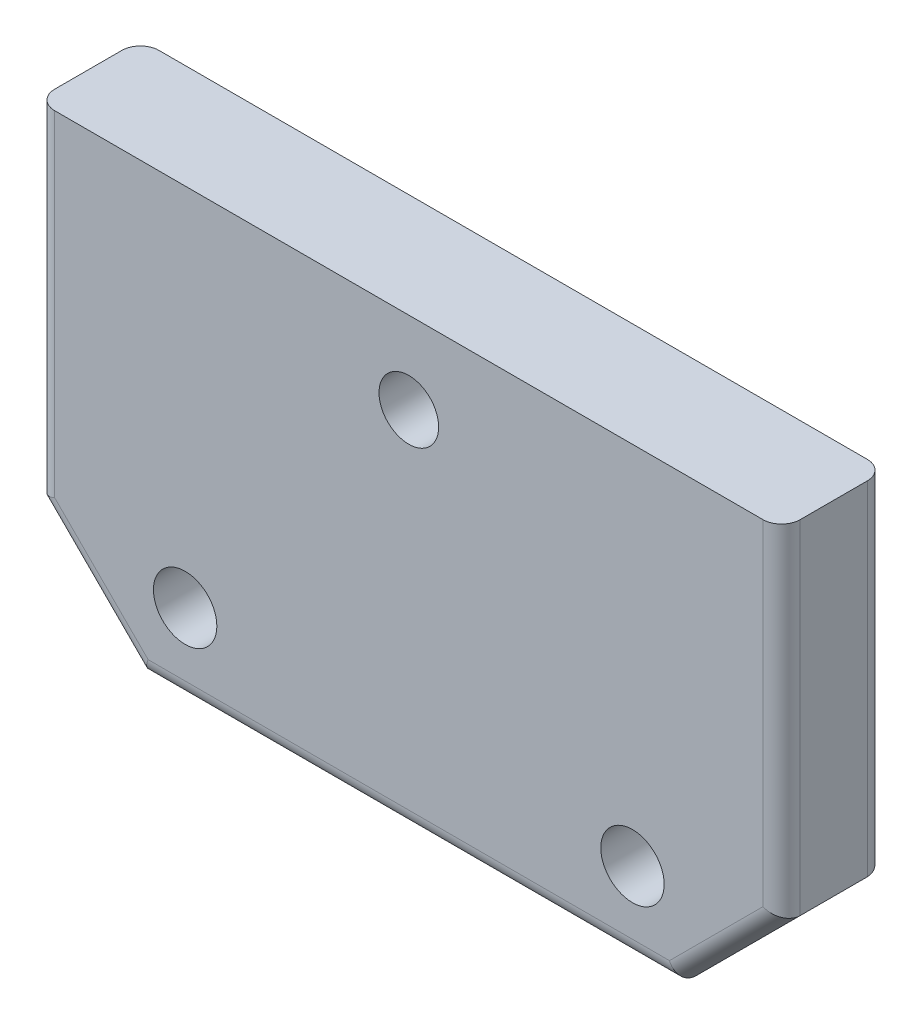
ISO-10303-21;
HEADER;
FILE_DESCRIPTION(('STEP AP214'),'2;1');
FILE_NAME('part.step','',(''),(''),'','','');
FILE_SCHEMA(('AUTOMOTIVE_DESIGN { 1 0 10303 214 1 1 1 1 }'));
ENDSEC;
DATA;
#1=APPLICATION_CONTEXT('core data for automotive mechanical design processes');
#2=APPLICATION_PROTOCOL_DEFINITION('international standard','automotive_design',2000,#1);
#3=PRODUCT_CONTEXT('',#1,'mechanical');
#4=PRODUCT('Part','Part','',(#3));
#5=PRODUCT_RELATED_PRODUCT_CATEGORY('part','',(#4));
#6=PRODUCT_DEFINITION_FORMATION('','',#4);
#7=PRODUCT_DEFINITION_CONTEXT('part definition',#1,'design');
#8=PRODUCT_DEFINITION('design','',#6,#7);
#9=PRODUCT_DEFINITION_SHAPE('','',#8);
#10=(LENGTH_UNIT() NAMED_UNIT(*) SI_UNIT(.MILLI.,.METRE.));
#11=(NAMED_UNIT(*) PLANE_ANGLE_UNIT() SI_UNIT($,.RADIAN.));
#12=(NAMED_UNIT(*) SI_UNIT($,.STERADIAN.) SOLID_ANGLE_UNIT());
#13=UNCERTAINTY_MEASURE_WITH_UNIT(LENGTH_MEASURE(1.E-05),#10,'distance_accuracy_value','');
#14=(GEOMETRIC_REPRESENTATION_CONTEXT(3) GLOBAL_UNCERTAINTY_ASSIGNED_CONTEXT((#13)) GLOBAL_UNIT_ASSIGNED_CONTEXT((#10,
#11,#12)) REPRESENTATION_CONTEXT('',''));
#15=CARTESIAN_POINT('',(0.,0.,0.));
#16=DIRECTION('',(0.,0.,1.));
#17=DIRECTION('',(1.,0.,0.));
#18=AXIS2_PLACEMENT_3D('',#15,#16,#17);
#19=CARTESIAN_POINT('',(-30.,0.999999999999978,7.));
#20=DIRECTION('',(0.,0.,-1.));
#21=DIRECTION('',(-1.,0.,0.));
#22=AXIS2_PLACEMENT_3D('',#19,#20,#21);
#23=CYLINDRICAL_SURFACE('',#22,4.25);
#24=CARTESIAN_POINT('',(-28.75,-3.062019202318,1.));
#25=CARTESIAN_POINT('',(-28.7500010188183,-3.06202002384616,0.931436926417596));
#26=CARTESIAN_POINT('',(-28.7556602682709,-3.06377411745014,0.86286371138975));
#27=CARTESIAN_POINT('',(-28.7780923124881,-3.07057426850515,0.727717591534308));
#28=CARTESIAN_POINT('',(-28.7948691539558,-3.07562152462734,0.661145424297023));
#29=CARTESIAN_POINT('',(-28.8389210669074,-3.08838798643787,0.531977081881191));
#30=CARTESIAN_POINT('',(-28.8661791825187,-3.09610287459705,0.469374674268693));
#31=CARTESIAN_POINT('',(-28.9303646013861,-3.1133295481344,0.349616983521839));
#32=CARTESIAN_POINT('',(-28.9672932288588,-3.12284157955187,0.292462447846429));
#33=CARTESIAN_POINT('',(-29.0509737875342,-3.14291522162274,0.183484454109766));
#34=CARTESIAN_POINT('',(-29.097968285881,-3.1534985261027,0.131851208528001));
#35=CARTESIAN_POINT('',(-29.1999264110724,-3.17433657893653,0.0370732775934072));
#36=CARTESIAN_POINT('',(-29.2548910220484,-3.18459128652481,-0.0060703579286417));
#37=CARTESIAN_POINT('',(-29.3725759773498,-3.20386234348636,-0.0834642783872464));
#38=CARTESIAN_POINT('',(-29.4354283628076,-3.21285014546562,-0.117521511658807));
#39=CARTESIAN_POINT('',(-29.5662771814844,-3.22832324357595,-0.174509941195111));
#40=CARTESIAN_POINT('',(-29.6342725471217,-3.23480905737478,-0.197443439242049));
#41=CARTESIAN_POINT('',(-29.7714879970808,-3.24439392585679,-0.230906487563591));
#42=CARTESIAN_POINT('',(-29.8406226630558,-3.24758140485661,-0.241760513923679));
#43=CARTESIAN_POINT('',(-29.9798003028342,-3.25052144756942,-0.251781563058182));
#44=CARTESIAN_POINT('',(-30.0498430901611,-3.25027470565526,-0.250950948376087));
#45=CARTESIAN_POINT('',(-30.1865756712177,-3.24643703464216,-0.237846070707477));
#46=CARTESIAN_POINT('',(-30.2533024593668,-3.24294874744345,-0.225923030514706));
#47=CARTESIAN_POINT('',(-30.3837624213812,-3.23314400444154,-0.191544309048748));
#48=CARTESIAN_POINT('',(-30.4474954083299,-3.22682737231062,-0.169087971093265));
#49=CARTESIAN_POINT('',(-30.5710048056453,-3.2119318903476,-0.114036624696429));
#50=CARTESIAN_POINT('',(-30.63072805662,-3.20332816159913,-0.0813293603801841));
#51=CARTESIAN_POINT('',(-30.7439521040271,-3.18477379645639,-0.00679287190829564));
#52=CARTESIAN_POINT('',(-30.7974514661492,-3.17482285073141,0.0350384485481024));
#53=CARTESIAN_POINT('',(-30.8988055414167,-3.15420566116511,0.128465319838518));
#54=CARTESIAN_POINT('',(-30.9463770996676,-3.14352657658912,0.180365616780812));
#55=CARTESIAN_POINT('',(-31.0322194667991,-3.12298149082425,0.291512782292381));
#56=CARTESIAN_POINT('',(-31.0704894244662,-3.11311556410408,0.350760322478043));
#57=CARTESIAN_POINT('',(-31.1369223366788,-3.09525415864894,0.475641076457775));
#58=CARTESIAN_POINT('',(-31.1649922920392,-3.08727611131961,0.541326437405536));
#59=CARTESIAN_POINT('',(-31.2095903770407,-3.0743019935185,0.676780251473856));
#60=CARTESIAN_POINT('',(-31.2261221006339,-3.06930499457418,0.746547425837689));
#61=CARTESIAN_POINT('',(-31.2466528550628,-3.0630614576329,0.885497996072304));
#62=CARTESIAN_POINT('',(-31.2510808389469,-3.06168661793756,0.954612301976942));
#63=CARTESIAN_POINT('',(-31.24847337039,-3.06248895789177,1.09259738918382));
#64=CARTESIAN_POINT('',(-31.2414394487506,-3.06466566321264,1.16146820177486));
#65=CARTESIAN_POINT('',(-31.2164891913203,-3.07220026548625,1.29524787237086));
#66=CARTESIAN_POINT('',(-31.1988456645307,-3.07747834041928,1.36021255936346));
#67=CARTESIAN_POINT('',(-31.1534915708057,-3.09053913849501,1.48625630112687));
#68=CARTESIAN_POINT('',(-31.1257794911964,-3.09832223796622,1.54733477042098));
#69=CARTESIAN_POINT('',(-31.0602509117557,-3.1157675842896,1.66562611315996));
#70=CARTESIAN_POINT('',(-31.0221906478307,-3.12547339058585,1.72269736877311));
#71=CARTESIAN_POINT('',(-30.9373378640316,-3.14557539478671,1.8297999781229));
#72=CARTESIAN_POINT('',(-30.8905433362974,-3.15597175108246,1.87982970848364));
#73=CARTESIAN_POINT('',(-30.7875395818903,-3.17673734027944,1.97328757853941));
#74=CARTESIAN_POINT('',(-30.7310516328979,-3.18709206666598,2.01641248103129));
#75=CARTESIAN_POINT('',(-30.6113960785099,-3.20622873879588,2.09257640994849));
#76=CARTESIAN_POINT('',(-30.5482288136786,-3.2150107646665,2.12561595027177));
#77=CARTESIAN_POINT('',(-30.417434850399,-3.22995779741894,2.18035326228051));
#78=CARTESIAN_POINT('',(-30.3498462496669,-3.23614244146317,2.20213643636309));
#79=CARTESIAN_POINT('',(-30.2117541845017,-3.24528461751225,2.23396802651774));
#80=CARTESIAN_POINT('',(-30.1412515242252,-3.24824303372869,2.24401965790431));
#81=CARTESIAN_POINT('',(-30.0021403163273,-3.25054778996798,2.25186607495326));
#82=CARTESIAN_POINT('',(-29.9335584560011,-3.25002398293167,2.25010147249262));
#83=CARTESIAN_POINT('',(-29.7977100604862,-3.24572691913205,2.23541324076557));
#84=CARTESIAN_POINT('',(-29.730443455834,-3.24195383445174,2.2224902024541));
#85=CARTESIAN_POINT('',(-29.5997849689642,-3.2316172176238,2.18612069671541));
#86=CARTESIAN_POINT('',(-29.5363611425137,-3.22508188084576,2.162780430784));
#87=CARTESIAN_POINT('',(-29.4142957585201,-3.2098976130732,2.10633372704934));
#88=CARTESIAN_POINT('',(-29.3556549708231,-3.20124834272588,2.0732257210398));
#89=CARTESIAN_POINT('',(-29.242840689085,-3.1824136753122,1.99698922635025));
#90=CARTESIAN_POINT('',(-29.1888626312379,-3.17218889677266,1.95358133365051));
#91=CARTESIAN_POINT('',(-29.0888091087242,-3.15148729633764,1.85848526711556));
#92=CARTESIAN_POINT('',(-29.0427358884889,-3.14101040381873,1.80679474961358));
#93=CARTESIAN_POINT('',(-28.958492793615,-3.12064287601546,1.69484335360865));
#94=CARTESIAN_POINT('',(-28.920583627286,-3.11077723881115,1.63438125496552));
#95=CARTESIAN_POINT('',(-28.8555145431195,-3.0931401583905,1.50766106366361));
#96=CARTESIAN_POINT('',(-28.8283490995856,-3.0853676393027,1.44140597191646));
#97=CARTESIAN_POINT('',(-28.7881950651446,-3.07362404243164,1.31305347193246));
#98=CARTESIAN_POINT('',(-28.7739102461419,-3.06931221106168,1.25139037889872));
#99=CARTESIAN_POINT('',(-28.7548131044647,-3.06350966845202,1.12648754148259));
#100=CARTESIAN_POINT('',(-28.7499990601601,-3.06201844447445,1.06324808577387));
#101=CARTESIAN_POINT('',(-28.75,-3.062019202318,1.));
#102=B_SPLINE_CURVE_WITH_KNOTS('',3,(#24,#25,#26,#27,#28,#29,#30,#31,#32,#33,#34,#35,#36,#37,
#38,#39,#40,#41,#42,#43,#44,#45,#46,#47,#48,#49,#50,#51,#52,#53,#54,#55,#56,#57,#58,#59,#60,#61,
#62,#63,#64,#65,#66,#67,#68,#69,#70,#71,#72,#73,#74,#75,#76,#77,#78,#79,#80,#81,#82,#83,#84,#85,
#86,#87,#88,#89,#90,#91,#92,#93,#94,#95,#96,#97,#98,#99,#100,#101),.UNSPECIFIED.,.T.,.F.,(4,2,2,
2,2,2,2,2,2,2,2,2,2,2,2,2,2,2,2,2,2,2,2,2,2,2,2,2,2,2,2,2,2,2,2,2,2,2,4),(0.,0.205456049939048,
0.410986925134936,0.616186696271427,0.821414580824591,1.03229554625482,1.24320257299881,
1.45828653945175,1.67332598058438,1.88243811419583,2.09150796756895,2.29417538337437,
2.4968554358487,2.70183748239909,2.90686667437467,3.11950461080055,3.33216199894912,
3.54671234326586,3.76119582914241,3.96797301274847,4.17472258236639,4.37637055499568,
4.5780488352438,4.78496568871061,4.99193016759003,5.2063604005066,5.42077970534145,
5.63354739380435,5.84625675440541,6.05107980739897,6.25589201355202,6.45866227343323,
6.66146510572097,6.87056974193599,7.07973365161175,7.29481976621886,7.50979511372942,
7.69935873828709,7.88888790012794),.UNSPECIFIED.);
#103=CARTESIAN_POINT('',(-28.75,-3.062019202318,1.));
#104=VERTEX_POINT('',#103);
#105=EDGE_CURVE('E399',#104,#104,#102,.T.);
#106=ORIENTED_EDGE('',*,*,#105,.F.);
#107=EDGE_LOOP('',(#106));
#108=FACE_BOUND('',#107,.T.);
#109=CARTESIAN_POINT('',(-30.,0.999999999999978,7.));
#110=DIRECTION('',(0.,0.,1.));
#111=DIRECTION('',(1.,0.,0.));
#112=AXIS2_PLACEMENT_3D('',#109,#110,#111);
#113=CIRCLE('',#112,4.25);
#114=CARTESIAN_POINT('',(-25.75,0.999999999999978,7.));
#115=VERTEX_POINT('',#114);
#116=EDGE_CURVE('E198',#115,#115,#113,.T.);
#117=ORIENTED_EDGE('',*,*,#116,.T.);
#118=EDGE_LOOP('',(#117));
#119=FACE_BOUND('',#118,.T.);
#120=CARTESIAN_POINT('',(-30.,0.999999999999978,-1.));
#121=DIRECTION('',(0.,0.,-1.));
#122=DIRECTION('',(-1.,0.,0.));
#123=AXIS2_PLACEMENT_3D('',#120,#121,#122);
#124=CIRCLE('',#123,4.25);
#125=CARTESIAN_POINT('',(-34.25,0.999999999999978,-1.));
#126=VERTEX_POINT('',#125);
#127=EDGE_CURVE('E221',#126,#126,#124,.T.);
#128=ORIENTED_EDGE('',*,*,#127,.T.);
#129=EDGE_LOOP('',(#128));
#130=FACE_BOUND('',#129,.T.);
#131=ADVANCED_FACE('F33',(#108,#119,#130),#23,.F.);
#132=CARTESIAN_POINT('',(30.,0.999999999999985,7.));
#133=DIRECTION('',(0.,0.,-1.));
#134=DIRECTION('',(-1.,0.,0.));
#135=AXIS2_PLACEMENT_3D('',#132,#133,#134);
#136=CYLINDRICAL_SURFACE('',#135,4.25000000000001);
#137=CARTESIAN_POINT('',(31.25,-3.062019202318,1.));
#138=CARTESIAN_POINT('',(31.2499989811817,-3.06202002384616,0.931436926417596));
#139=CARTESIAN_POINT('',(31.2443397317291,-3.06377411745014,0.86286371138975));
#140=CARTESIAN_POINT('',(31.2219076875119,-3.07057426850515,0.727717591534308));
#141=CARTESIAN_POINT('',(31.2051308460442,-3.07562152462734,0.661145424297023));
#142=CARTESIAN_POINT('',(31.1610789330926,-3.08838798643787,0.531977081881191));
#143=CARTESIAN_POINT('',(31.1338208174813,-3.09610287459705,0.469374674268693));
#144=CARTESIAN_POINT('',(31.0696353986139,-3.1133295481344,0.349616983521839));
#145=CARTESIAN_POINT('',(31.0327067711412,-3.12284157955187,0.29246244784643));
#146=CARTESIAN_POINT('',(30.9490262124658,-3.14291522162274,0.183484454109766));
#147=CARTESIAN_POINT('',(30.902031714119,-3.1534985261027,0.131851208528001));
#148=CARTESIAN_POINT('',(30.8000735889276,-3.17433657893653,0.0370732775934072));
#149=CARTESIAN_POINT('',(30.7451089779516,-3.18459128652481,-0.0060703579286414));
#150=CARTESIAN_POINT('',(30.6274240226502,-3.20386234348636,-0.0834642783872454));
#151=CARTESIAN_POINT('',(30.5645716371924,-3.21285014546562,-0.117521511658806));
#152=CARTESIAN_POINT('',(30.4337228185156,-3.22832324357595,-0.174509941195111));
#153=CARTESIAN_POINT('',(30.3657274528783,-3.23480905737478,-0.197443439242048));
#154=CARTESIAN_POINT('',(30.2285120029192,-3.24439392585679,-0.230906487563591));
#155=CARTESIAN_POINT('',(30.1593773369442,-3.24758140485661,-0.241760513923679));
#156=CARTESIAN_POINT('',(30.0201996971658,-3.25052144756942,-0.251781563058182));
#157=CARTESIAN_POINT('',(29.9501569098389,-3.25027470565526,-0.250950948376087));
#158=CARTESIAN_POINT('',(29.8134243287823,-3.24643703464216,-0.237846070707477));
#159=CARTESIAN_POINT('',(29.7466975406332,-3.24294874744345,-0.225923030514707));
#160=CARTESIAN_POINT('',(29.6162375786188,-3.23314400444154,-0.191544309048748));
#161=CARTESIAN_POINT('',(29.5525045916701,-3.22682737231062,-0.169087971093265));
#162=CARTESIAN_POINT('',(29.4289951943547,-3.2119318903476,-0.114036624696429));
#163=CARTESIAN_POINT('',(29.36927194338,-3.20332816159913,-0.0813293603801841));
#164=CARTESIAN_POINT('',(29.2560478959729,-3.18477379645639,-0.00679287190829565));
#165=CARTESIAN_POINT('',(29.2025485338508,-3.17482285073141,0.0350384485481024));
#166=CARTESIAN_POINT('',(29.1011944585833,-3.15420566116511,0.128465319838518));
#167=CARTESIAN_POINT('',(29.0536229003324,-3.14352657658912,0.180365616780812));
#168=CARTESIAN_POINT('',(28.9677805332009,-3.12298149082424,0.291512782292383));
#169=CARTESIAN_POINT('',(28.9295105755337,-3.11311556410408,0.350760322478045));
#170=CARTESIAN_POINT('',(28.8630776633212,-3.09525415864894,0.475641076457778));
#171=CARTESIAN_POINT('',(28.8350077079608,-3.08727611131961,0.541326437405539));
#172=CARTESIAN_POINT('',(28.7904096229593,-3.0743019935185,0.676780251473858));
#173=CARTESIAN_POINT('',(28.7738778993661,-3.06930499457418,0.746547425837689));
#174=CARTESIAN_POINT('',(28.7533471449372,-3.0630614576329,0.885497996072302));
#175=CARTESIAN_POINT('',(28.7489191610531,-3.06168661793756,0.954612301976941));
#176=CARTESIAN_POINT('',(28.75152662961,-3.06248895789177,1.09259738918382));
#177=CARTESIAN_POINT('',(28.7585605512494,-3.06466566321264,1.16146820177486));
#178=CARTESIAN_POINT('',(28.7835108086797,-3.07220026548625,1.29524787237086));
#179=CARTESIAN_POINT('',(28.8011543354693,-3.07747834041928,1.36021255936346));
#180=CARTESIAN_POINT('',(28.8465084291943,-3.09053913849501,1.48625630112687));
#181=CARTESIAN_POINT('',(28.8742205088036,-3.09832223796623,1.54733477042098));
#182=CARTESIAN_POINT('',(28.9397490882443,-3.1157675842896,1.66562611315996));
#183=CARTESIAN_POINT('',(28.9778093521693,-3.12547339058584,1.72269736877311));
#184=CARTESIAN_POINT('',(29.0626621359684,-3.14557539478671,1.8297999781229));
#185=CARTESIAN_POINT('',(29.1094566637025,-3.15597175108246,1.87982970848364));
#186=CARTESIAN_POINT('',(29.2124604181097,-3.17673734027944,1.97328757853941));
#187=CARTESIAN_POINT('',(29.2689483671021,-3.18709206666598,2.01641248103129));
#188=CARTESIAN_POINT('',(29.3886039214901,-3.20622873879587,2.09257640994849));
#189=CARTESIAN_POINT('',(29.4517711863214,-3.21501076466649,2.12561595027177));
#190=CARTESIAN_POINT('',(29.582565149601,-3.22995779741894,2.18035326228051));
#191=CARTESIAN_POINT('',(29.6501537503331,-3.23614244146317,2.20213643636309));
#192=CARTESIAN_POINT('',(29.7882458154983,-3.24528461751225,2.23396802651774));
#193=CARTESIAN_POINT('',(29.8587484757748,-3.24824303372869,2.24401965790431));
#194=CARTESIAN_POINT('',(29.9978596836727,-3.25054778996798,2.25186607495326));
#195=CARTESIAN_POINT('',(30.0664415439989,-3.25002398293167,2.25010147249262));
#196=CARTESIAN_POINT('',(30.2022899395138,-3.24572691913205,2.23541324076557));
#197=CARTESIAN_POINT('',(30.269556544166,-3.24195383445174,2.2224902024541));
#198=CARTESIAN_POINT('',(30.4002150310358,-3.2316172176238,2.18612069671541));
#199=CARTESIAN_POINT('',(30.4636388574863,-3.22508188084576,2.162780430784));
#200=CARTESIAN_POINT('',(30.5857042414799,-3.2098976130732,2.10633372704934));
#201=CARTESIAN_POINT('',(30.6443450291769,-3.20124834272588,2.0732257210398));
#202=CARTESIAN_POINT('',(30.757159310915,-3.1824136753122,1.99698922635025));
#203=CARTESIAN_POINT('',(30.8111373687621,-3.17218889677266,1.95358133365051));
#204=CARTESIAN_POINT('',(30.9111908912758,-3.15148729633764,1.85848526711556));
#205=CARTESIAN_POINT('',(30.9572641115111,-3.14101040381873,1.80679474961358));
#206=CARTESIAN_POINT('',(31.041507206385,-3.12064287601546,1.69484335360865));
#207=CARTESIAN_POINT('',(31.0794163727139,-3.11077723881115,1.63438125496552));
#208=CARTESIAN_POINT('',(31.1444854568805,-3.0931401583905,1.50766106366361));
#209=CARTESIAN_POINT('',(31.1716509004144,-3.0853676393027,1.44140597191646));
#210=CARTESIAN_POINT('',(31.2118049348554,-3.07362404243164,1.31305347193246));
#211=CARTESIAN_POINT('',(31.2260897538581,-3.06931221106168,1.25139037889872));
#212=CARTESIAN_POINT('',(31.2451868955353,-3.06350966845202,1.12648754148259));
#213=CARTESIAN_POINT('',(31.2500009398399,-3.06201844447445,1.06324808577387));
#214=CARTESIAN_POINT('',(31.25,-3.062019202318,1.));
#215=B_SPLINE_CURVE_WITH_KNOTS('',3,(#137,#138,#139,#140,#141,#142,#143,#144,#145,#146,#147,
#148,#149,#150,#151,#152,#153,#154,#155,#156,#157,#158,#159,#160,#161,#162,#163,#164,#165,#166,
#167,#168,#169,#170,#171,#172,#173,#174,#175,#176,#177,#178,#179,#180,#181,#182,#183,#184,#185,
#186,#187,#188,#189,#190,#191,#192,#193,#194,#195,#196,#197,#198,#199,#200,#201,#202,#203,#204,
#205,#206,#207,#208,#209,#210,#211,#212,#213,#214),.UNSPECIFIED.,.T.,.F.,(4,2,2,2,2,2,2,2,2,2,2,
2,2,2,2,2,2,2,2,2,2,2,2,2,2,2,2,2,2,2,2,2,2,2,2,2,2,2,4),(0.,0.205456049939047,
0.410986925134936,0.616186696271427,0.821414580824591,1.03229554625482,1.24320257299881,
1.45828653945174,1.67332598058438,1.88243811419583,2.09150796756895,2.29417538337437,
2.4968554358487,2.70183748239909,2.90686667437467,3.11950461080055,3.33216199894913,
3.54671234326586,3.76119582914241,3.96797301274847,4.17472258236639,4.37637055499568,
4.5780488352438,4.78496568871061,4.99193016759003,5.2063604005066,5.42077970534145,
5.63354739380435,5.84625675440541,6.05107980739897,6.25589201355202,6.45866227343323,
6.66146510572097,6.87056974193598,7.07973365161175,7.29481976621886,7.50979511372942,
7.69935873828709,7.88888790012794),.UNSPECIFIED.);
#216=CARTESIAN_POINT('',(31.25,-3.062019202318,1.));
#217=VERTEX_POINT('',#216);
#218=EDGE_CURVE('E175',#217,#217,#215,.T.);
#219=ORIENTED_EDGE('',*,*,#218,.F.);
#220=EDGE_LOOP('',(#219));
#221=FACE_BOUND('',#220,.T.);
#222=CARTESIAN_POINT('',(30.,0.999999999999985,7.));
#223=DIRECTION('',(0.,0.,1.));
#224=DIRECTION('',(1.,0.,0.));
#225=AXIS2_PLACEMENT_3D('',#222,#223,#224);
#226=CIRCLE('',#225,4.25000000000001);
#227=CARTESIAN_POINT('',(34.25,0.999999999999985,7.));
#228=VERTEX_POINT('',#227);
#229=EDGE_CURVE('E205',#228,#228,#226,.T.);
#230=ORIENTED_EDGE('',*,*,#229,.T.);
#231=EDGE_LOOP('',(#230));
#232=FACE_BOUND('',#231,.T.);
#233=CARTESIAN_POINT('',(30.,0.999999999999985,-1.));
#234=DIRECTION('',(0.,0.,-1.));
#235=DIRECTION('',(-1.,0.,0.));
#236=AXIS2_PLACEMENT_3D('',#233,#234,#235);
#237=CIRCLE('',#236,4.25000000000001);
#238=CARTESIAN_POINT('',(25.75,0.999999999999985,-1.));
#239=VERTEX_POINT('',#238);
#240=EDGE_CURVE('E202',#239,#239,#237,.T.);
#241=ORIENTED_EDGE('',*,*,#240,.T.);
#242=EDGE_LOOP('',(#241));
#243=FACE_BOUND('',#242,.T.);
#244=ADVANCED_FACE('F384',(#221,#232,#243),#136,.F.);
#245=CARTESIAN_POINT('',(0.,0.,7.));
#246=DIRECTION('',(0.,0.,-1.));
#247=DIRECTION('',(-1.,0.,0.));
#248=AXIS2_PLACEMENT_3D('',#245,#246,#247);
#249=PLANE('',#248);
#250=DIRECTION('',(-0.707106781186549,-0.707106781186546,0.));
#251=VECTOR('',#250,1.);
#252=CARTESIAN_POINT('',(48.2322330470336,5.76776695296638,7.));
#253=LINE('',#252,#251);
#254=CARTESIAN_POINT('',(34.9644660940672,-7.5,7.));
#255=VERTEX_POINT('',#254);
#256=CARTESIAN_POINT('',(47.5,5.03553390593274,7.));
#257=VERTEX_POINT('',#256);
#258=EDGE_CURVE('E243',#255,#257,#253,.F.);
#259=ORIENTED_EDGE('',*,*,#258,.T.);
#260=DIRECTION('',(0.,1.,0.));
#261=VECTOR('',#260,1.);
#262=CARTESIAN_POINT('',(47.5,0.,7.));
#263=LINE('',#262,#261);
#264=CARTESIAN_POINT('',(47.5,50.,7.));
#265=VERTEX_POINT('',#264);
#266=EDGE_CURVE('E245',#257,#265,#263,.T.);
#267=ORIENTED_EDGE('',*,*,#266,.T.);
#268=DIRECTION('',(-1.,0.,0.));
#269=VECTOR('',#268,1.);
#270=CARTESIAN_POINT('',(-50.,50.,7.));
#271=LINE('',#270,#269);
#272=CARTESIAN_POINT('',(-47.5,50.,7.));
#273=VERTEX_POINT('',#272);
#274=EDGE_CURVE('E209',#265,#273,#271,.T.);
#275=ORIENTED_EDGE('',*,*,#274,.T.);
#276=DIRECTION('',(0.,-1.,0.));
#277=VECTOR('',#276,1.);
#278=CARTESIAN_POINT('',(-47.5,0.,7.));
#279=LINE('',#278,#277);
#280=CARTESIAN_POINT('',(-47.5,5.03553390593277,7.));
#281=VERTEX_POINT('',#280);
#282=EDGE_CURVE('E236',#273,#281,#279,.T.);
#283=ORIENTED_EDGE('',*,*,#282,.T.);
#284=DIRECTION('',(-0.707106781186546,0.707106781186549,0.));
#285=VECTOR('',#284,1.);
#286=CARTESIAN_POINT('',(-34.2322330470336,-8.23223304703365,7.));
#287=LINE('',#286,#285);
#288=CARTESIAN_POINT('',(-34.9644660940673,-7.50000000000001,7.));
#289=VERTEX_POINT('',#288);
#290=EDGE_CURVE('E238',#281,#289,#287,.F.);
#291=ORIENTED_EDGE('',*,*,#290,.T.);
#292=DIRECTION('',(1.,0.,0.));
#293=VECTOR('',#292,1.);
#294=CARTESIAN_POINT('',(0.,-7.50000000000001,7.));
#295=LINE('',#294,#293);
#296=EDGE_CURVE('E240',#289,#255,#295,.T.);
#297=ORIENTED_EDGE('',*,*,#296,.T.);
#298=EDGE_LOOP('',(#259,#267,#275,#283,#291,#297));
#299=FACE_BOUND('',#298,.T.);
#300=ORIENTED_EDGE('',*,*,#229,.F.);
#301=EDGE_LOOP('',(#300));
#302=FACE_BOUND('',#301,.T.);
#303=ORIENTED_EDGE('',*,*,#116,.F.);
#304=EDGE_LOOP('',(#303));
#305=FACE_BOUND('',#304,.T.);
#306=CARTESIAN_POINT('',(0.,39.,7.));
#307=DIRECTION('',(0.,0.,1.));
#308=DIRECTION('',(1.,0.,0.));
#309=AXIS2_PLACEMENT_3D('',#306,#307,#308);
#310=CIRCLE('',#309,4.);
#311=CARTESIAN_POINT('',(4.,39.,7.));
#312=VERTEX_POINT('',#311);
#313=EDGE_CURVE('E195',#312,#312,#310,.T.);
#314=ORIENTED_EDGE('',*,*,#313,.F.);
#315=EDGE_LOOP('',(#314));
#316=FACE_BOUND('',#315,.T.);
#317=ADVANCED_FACE('F364',(#299,#302,#305,#316),#249,.F.);
#318=CARTESIAN_POINT('',(0.,0.,-7.));
#319=DIRECTION('',(0.,0.,-1.));
#320=DIRECTION('',(-1.,0.,0.));
#321=AXIS2_PLACEMENT_3D('',#318,#319,#320);
#322=PLANE('',#321);
#323=DIRECTION('',(0.,-1.,0.));
#324=VECTOR('',#323,1.);
#325=CARTESIAN_POINT('',(15.,27.881077188656,-7.));
#326=LINE('',#325,#324);
#327=CARTESIAN_POINT('',(15.,27.881077188656,-7.));
#328=VERTEX_POINT('',#327);
#329=CARTESIAN_POINT('',(15.,5.88107718865601,-7.));
#330=VERTEX_POINT('',#329);
#331=EDGE_CURVE('E50',#328,#330,#326,.T.);
#332=ORIENTED_EDGE('',*,*,#331,.F.);
#333=DIRECTION('',(1.,0.,0.));
#334=VECTOR('',#333,1.);
#335=CARTESIAN_POINT('',(-15.,27.881077188656,-7.));
#336=LINE('',#335,#334);
#337=CARTESIAN_POINT('',(-15.,27.881077188656,-7.));
#338=VERTEX_POINT('',#337);
#339=EDGE_CURVE('E169',#338,#328,#336,.T.);
#340=ORIENTED_EDGE('',*,*,#339,.F.);
#341=DIRECTION('',(0.,1.,0.));
#342=VECTOR('',#341,1.);
#343=CARTESIAN_POINT('',(-15.,27.881077188656,-7.));
#344=LINE('',#343,#342);
#345=CARTESIAN_POINT('',(-15.,5.88107718865601,-7.));
#346=VERTEX_POINT('',#345);
#347=EDGE_CURVE('E172',#346,#338,#344,.T.);
#348=ORIENTED_EDGE('',*,*,#347,.F.);
#349=DIRECTION('',(-1.,0.,0.));
#350=VECTOR('',#349,1.);
#351=CARTESIAN_POINT('',(-15.,5.88107718865601,-7.));
#352=LINE('',#351,#350);
#353=EDGE_CURVE('E185',#330,#346,#352,.T.);
#354=ORIENTED_EDGE('',*,*,#353,.F.);
#355=EDGE_LOOP('',(#332,#340,#348,#354));
#356=FACE_BOUND('',#355,.T.);
#357=DIRECTION('',(-1.,0.,0.));
#358=VECTOR('',#357,1.);
#359=CARTESIAN_POINT('',(-50.,50.,-7.));
#360=LINE('',#359,#358);
#361=CARTESIAN_POINT('',(47.5,50.,-7.));
#362=VERTEX_POINT('',#361);
#363=CARTESIAN_POINT('',(-47.5,50.,-7.));
#364=VERTEX_POINT('',#363);
#365=EDGE_CURVE('E208',#362,#364,#360,.T.);
#366=ORIENTED_EDGE('',*,*,#365,.F.);
#367=DIRECTION('',(0.,1.,0.));
#368=VECTOR('',#367,1.);
#369=CARTESIAN_POINT('',(47.5,4.00000000000001,-7.));
#370=LINE('',#369,#368);
#371=CARTESIAN_POINT('',(47.5,5.03553390593275,-7.));
#372=VERTEX_POINT('',#371);
#373=EDGE_CURVE('E260',#362,#372,#370,.F.);
#374=ORIENTED_EDGE('',*,*,#373,.T.);
#375=DIRECTION('',(0.707106781186549,0.707106781186546,0.));
#376=VECTOR('',#375,1.);
#377=CARTESIAN_POINT('',(21.2322330470336,-21.2322330470336,-7.));
#378=LINE('',#377,#376);
#379=CARTESIAN_POINT('',(34.9644660940672,-7.5,-7.));
#380=VERTEX_POINT('',#379);
#381=EDGE_CURVE('E258',#372,#380,#378,.F.);
#382=ORIENTED_EDGE('',*,*,#381,.T.);
#383=DIRECTION('',(1.,0.,0.));
#384=VECTOR('',#383,1.);
#385=CARTESIAN_POINT('',(-36.,-7.50000000000001,-7.));
#386=LINE('',#385,#384);
#387=CARTESIAN_POINT('',(-34.9644660940673,-7.50000000000001,-7.));
#388=VERTEX_POINT('',#387);
#389=EDGE_CURVE('E256',#380,#388,#386,.F.);
#390=ORIENTED_EDGE('',*,*,#389,.T.);
#391=DIRECTION('',(0.707106781186546,-0.707106781186549,0.));
#392=VECTOR('',#391,1.);
#393=CARTESIAN_POINT('',(-21.2322330470337,-21.2322330470336,-7.));
#394=LINE('',#393,#392);
#395=CARTESIAN_POINT('',(-47.5,5.03553390593277,-7.));
#396=VERTEX_POINT('',#395);
#397=EDGE_CURVE('E254',#388,#396,#394,.F.);
#398=ORIENTED_EDGE('',*,*,#397,.T.);
#399=DIRECTION('',(0.,-1.,0.));
#400=VECTOR('',#399,1.);
#401=CARTESIAN_POINT('',(-47.5,50.,-7.));
#402=LINE('',#401,#400);
#403=EDGE_CURVE('E252',#396,#364,#402,.F.);
#404=ORIENTED_EDGE('',*,*,#403,.T.);
#405=EDGE_LOOP('',(#366,#374,#382,#390,#398,#404));
#406=FACE_BOUND('',#405,.T.);
#407=CARTESIAN_POINT('',(0.,39.,-7.));
#408=DIRECTION('',(0.,0.,1.));
#409=DIRECTION('',(1.,0.,0.));
#410=AXIS2_PLACEMENT_3D('',#407,#408,#409);
#411=CIRCLE('',#410,4.);
#412=CARTESIAN_POINT('',(4.,39.,-7.));
#413=VERTEX_POINT('',#412);
#414=EDGE_CURVE('E199',#413,#413,#411,.T.);
#415=ORIENTED_EDGE('',*,*,#414,.T.);
#416=EDGE_LOOP('',(#415));
#417=FACE_BOUND('',#416,.T.);
#418=ADVANCED_FACE('F313',(#356,#406,#417),#322,.T.);
#419=CARTESIAN_POINT('',(-50.,-10.,7.));
#420=DIRECTION('',(1.,0.,0.));
#421=DIRECTION('',(0.,0.,-1.));
#422=AXIS2_PLACEMENT_3D('',#419,#420,#421);
#423=PLANE('',#422);
#424=DIRECTION('',(0.,0.,1.));
#425=VECTOR('',#424,1.);
#426=CARTESIAN_POINT('',(-50.,4.00000000000003,7.));
#427=LINE('',#426,#425);
#428=CARTESIAN_POINT('',(-50.,4.00000000000003,-4.5));
#429=VERTEX_POINT('',#428);
#430=CARTESIAN_POINT('',(-50.,4.00000000000003,4.5));
#431=VERTEX_POINT('',#430);
#432=EDGE_CURVE('E230',#429,#431,#427,.T.);
#433=ORIENTED_EDGE('',*,*,#432,.T.);
#434=DIRECTION('',(0.,-1.,0.));
#435=VECTOR('',#434,1.);
#436=CARTESIAN_POINT('',(-50.,-10.,4.5));
#437=LINE('',#436,#435);
#438=CARTESIAN_POINT('',(-50.,50.,4.5));
#439=VERTEX_POINT('',#438);
#440=EDGE_CURVE('E11',#431,#439,#437,.F.);
#441=ORIENTED_EDGE('',*,*,#440,.T.);
#442=DIRECTION('',(0.,0.,-1.));
#443=VECTOR('',#442,1.);
#444=CARTESIAN_POINT('',(-50.,50.,7.));
#445=LINE('',#444,#443);
#446=CARTESIAN_POINT('',(-50.,50.,-4.5));
#447=VERTEX_POINT('',#446);
#448=EDGE_CURVE('E212',#439,#447,#445,.T.);
#449=ORIENTED_EDGE('',*,*,#448,.T.);
#450=DIRECTION('',(0.,-1.,0.));
#451=VECTOR('',#450,1.);
#452=CARTESIAN_POINT('',(-50.,4.00000000000003,-4.5));
#453=LINE('',#452,#451);
#454=EDGE_CURVE('E42',#447,#429,#453,.T.);
#455=ORIENTED_EDGE('',*,*,#454,.T.);
#456=EDGE_LOOP('',(#433,#441,#449,#455));
#457=FACE_BOUND('',#456,.T.);
#458=ADVANCED_FACE('F360',(#457),#423,.F.);
#459=CARTESIAN_POINT('',(-50.,-10.,7.));
#460=DIRECTION('',(0.,1.,0.));
#461=DIRECTION('',(-1.,0.,0.));
#462=AXIS2_PLACEMENT_3D('',#459,#460,#461);
#463=PLANE('',#462);
#464=CARTESIAN_POINT('',(30.,-10.,1.));
#465=DIRECTION('',(0.,-1.,0.));
#466=DIRECTION('',(1.,0.,0.));
#467=AXIS2_PLACEMENT_3D('',#464,#465,#466);
#468=CIRCLE('',#467,1.25);
#469=CARTESIAN_POINT('',(31.25,-10.,1.));
#470=VERTEX_POINT('',#469);
#471=EDGE_CURVE('E405',#470,#470,#468,.T.);
#472=ORIENTED_EDGE('',*,*,#471,.F.);
#473=EDGE_LOOP('',(#472));
#474=FACE_BOUND('',#473,.T.);
#475=CARTESIAN_POINT('',(-30.,-10.,1.));
#476=DIRECTION('',(0.,-1.,0.));
#477=DIRECTION('',(-1.,0.,0.));
#478=AXIS2_PLACEMENT_3D('',#475,#476,#477);
#479=CIRCLE('',#478,1.25);
#480=CARTESIAN_POINT('',(-31.25,-10.,1.));
#481=VERTEX_POINT('',#480);
#482=EDGE_CURVE('E406',#481,#481,#479,.T.);
#483=ORIENTED_EDGE('',*,*,#482,.F.);
#484=EDGE_LOOP('',(#483));
#485=FACE_BOUND('',#484,.T.);
#486=DIRECTION('',(0.,0.,1.));
#487=VECTOR('',#486,1.);
#488=CARTESIAN_POINT('',(36.,-10.,7.));
#489=LINE('',#488,#487);
#490=CARTESIAN_POINT('',(36.,-10.,-4.5));
#491=VERTEX_POINT('',#490);
#492=CARTESIAN_POINT('',(36.,-10.,4.5));
#493=VERTEX_POINT('',#492);
#494=EDGE_CURVE('E218',#491,#493,#489,.T.);
#495=ORIENTED_EDGE('',*,*,#494,.T.);
#496=DIRECTION('',(1.,0.,0.));
#497=VECTOR('',#496,1.);
#498=CARTESIAN_POINT('',(-50.,-10.,4.5));
#499=LINE('',#498,#497);
#500=CARTESIAN_POINT('',(-36.,-10.,4.5));
#501=VERTEX_POINT('',#500);
#502=EDGE_CURVE('E250',#493,#501,#499,.F.);
#503=ORIENTED_EDGE('',*,*,#502,.T.);
#504=DIRECTION('',(0.,0.,-1.));
#505=VECTOR('',#504,1.);
#506=CARTESIAN_POINT('',(-36.,-10.,7.));
#507=LINE('',#506,#505);
#508=CARTESIAN_POINT('',(-36.,-10.,-4.5));
#509=VERTEX_POINT('',#508);
#510=EDGE_CURVE('E227',#501,#509,#507,.T.);
#511=ORIENTED_EDGE('',*,*,#510,.T.);
#512=DIRECTION('',(1.,0.,0.));
#513=VECTOR('',#512,1.);
#514=CARTESIAN_POINT('',(36.,-10.,-4.5));
#515=LINE('',#514,#513);
#516=EDGE_CURVE('E247',#509,#491,#515,.T.);
#517=ORIENTED_EDGE('',*,*,#516,.T.);
#518=EDGE_LOOP('',(#495,#503,#511,#517));
#519=FACE_BOUND('',#518,.T.);
#520=ADVANCED_FACE('F332',(#474,#485,#519),#463,.F.);
#521=CARTESIAN_POINT('',(50.,-10.,7.));
#522=DIRECTION('',(-1.,0.,0.));
#523=DIRECTION('',(0.,-1.,0.));
#524=AXIS2_PLACEMENT_3D('',#521,#522,#523);
#525=PLANE('',#524);
#526=DIRECTION('',(0.,0.,-1.));
#527=VECTOR('',#526,1.);
#528=CARTESIAN_POINT('',(50.,4.00000000000001,7.));
#529=LINE('',#528,#527);
#530=CARTESIAN_POINT('',(50.,4.00000000000001,4.5));
#531=VERTEX_POINT('',#530);
#532=CARTESIAN_POINT('',(50.,4.00000000000001,-4.5));
#533=VERTEX_POINT('',#532);
#534=EDGE_CURVE('E233',#531,#533,#529,.T.);
#535=ORIENTED_EDGE('',*,*,#534,.T.);
#536=DIRECTION('',(0.,1.,0.));
#537=VECTOR('',#536,1.);
#538=CARTESIAN_POINT('',(50.,50.,-4.5));
#539=LINE('',#538,#537);
#540=CARTESIAN_POINT('',(50.,50.,-4.5));
#541=VERTEX_POINT('',#540);
#542=EDGE_CURVE('E272',#533,#541,#539,.T.);
#543=ORIENTED_EDGE('',*,*,#542,.T.);
#544=DIRECTION('',(0.,0.,-1.));
#545=VECTOR('',#544,1.);
#546=CARTESIAN_POINT('',(50.,50.,7.));
#547=LINE('',#546,#545);
#548=CARTESIAN_POINT('',(50.,50.,4.5));
#549=VERTEX_POINT('',#548);
#550=EDGE_CURVE('E215',#549,#541,#547,.T.);
#551=ORIENTED_EDGE('',*,*,#550,.F.);
#552=DIRECTION('',(0.,1.,0.));
#553=VECTOR('',#552,1.);
#554=CARTESIAN_POINT('',(50.,-10.,4.5));
#555=LINE('',#554,#553);
#556=EDGE_CURVE('E270',#549,#531,#555,.F.);
#557=ORIENTED_EDGE('',*,*,#556,.T.);
#558=EDGE_LOOP('',(#535,#543,#551,#557));
#559=FACE_BOUND('',#558,.T.);
#560=ADVANCED_FACE('F371',(#559),#525,.F.);
#561=CARTESIAN_POINT('',(-50.,50.,7.));
#562=DIRECTION('',(0.,-1.,0.));
#563=DIRECTION('',(1.,0.,0.));
#564=AXIS2_PLACEMENT_3D('',#561,#562,#563);
#565=PLANE('',#564);
#566=ORIENTED_EDGE('',*,*,#550,.T.);
#567=CARTESIAN_POINT('',(47.5,50.,-4.5));
#568=DIRECTION('',(0.,-1.,0.));
#569=DIRECTION('',(1.,0.,0.));
#570=AXIS2_PLACEMENT_3D('',#567,#568,#569);
#571=CIRCLE('',#570,2.5);
#572=EDGE_CURVE('E279',#541,#362,#571,.F.);
#573=ORIENTED_EDGE('',*,*,#572,.T.);
#574=ORIENTED_EDGE('',*,*,#365,.T.);
#575=CARTESIAN_POINT('',(-47.5,50.,-4.5));
#576=DIRECTION('',(0.,-1.,0.));
#577=DIRECTION('',(1.,0.,0.));
#578=AXIS2_PLACEMENT_3D('',#575,#576,#577);
#579=CIRCLE('',#578,2.5);
#580=EDGE_CURVE('E58',#364,#447,#579,.F.);
#581=ORIENTED_EDGE('',*,*,#580,.T.);
#582=ORIENTED_EDGE('',*,*,#448,.F.);
#583=CARTESIAN_POINT('',(-47.5,50.,4.5));
#584=DIRECTION('',(0.,-1.,0.));
#585=DIRECTION('',(1.,0.,0.));
#586=AXIS2_PLACEMENT_3D('',#583,#584,#585);
#587=CIRCLE('',#586,2.5);
#588=EDGE_CURVE('E275',#439,#273,#587,.F.);
#589=ORIENTED_EDGE('',*,*,#588,.T.);
#590=ORIENTED_EDGE('',*,*,#274,.F.);
#591=CARTESIAN_POINT('',(47.5,50.,4.5));
#592=DIRECTION('',(0.,-1.,0.));
#593=DIRECTION('',(1.,0.,0.));
#594=AXIS2_PLACEMENT_3D('',#591,#592,#593);
#595=CIRCLE('',#594,2.5);
#596=EDGE_CURVE('E277',#265,#549,#595,.F.);
#597=ORIENTED_EDGE('',*,*,#596,.T.);
#598=EDGE_LOOP('',(#566,#573,#574,#581,#582,#589,#590,#597));
#599=FACE_BOUND('',#598,.T.);
#600=ADVANCED_FACE('F316',(#599),#565,.F.);
#601=CARTESIAN_POINT('',(0.,39.,7.));
#602=DIRECTION('',(0.,0.,-1.));
#603=DIRECTION('',(-1.,0.,0.));
#604=AXIS2_PLACEMENT_3D('',#601,#602,#603);
#605=CYLINDRICAL_SURFACE('',#604,4.);
#606=ORIENTED_EDGE('',*,*,#313,.T.);
#607=EDGE_LOOP('',(#606));
#608=FACE_BOUND('',#607,.T.);
#609=ORIENTED_EDGE('',*,*,#414,.F.);
#610=EDGE_LOOP('',(#609));
#611=FACE_BOUND('',#610,.T.);
#612=ADVANCED_FACE('F378',(#608,#611),#605,.F.);
#613=CARTESIAN_POINT('',(30.,0.999999999999985,-1.));
#614=DIRECTION('',(0.,0.,-1.));
#615=DIRECTION('',(-1.,0.,0.));
#616=AXIS2_PLACEMENT_3D('',#613,#614,#615);
#617=PLANE('',#616);
#618=ORIENTED_EDGE('',*,*,#240,.F.);
#619=EDGE_LOOP('',(#618));
#620=FACE_BOUND('',#619,.T.);
#621=ADVANCED_FACE('F431',(#620),#617,.F.);
#622=CARTESIAN_POINT('',(-30.,0.999999999999978,-1.));
#623=DIRECTION('',(0.,0.,-1.));
#624=DIRECTION('',(-1.,0.,0.));
#625=AXIS2_PLACEMENT_3D('',#622,#623,#624);
#626=PLANE('',#625);
#627=ORIENTED_EDGE('',*,*,#127,.F.);
#628=EDGE_LOOP('',(#627));
#629=FACE_BOUND('',#628,.T.);
#630=ADVANCED_FACE('F429',(#629),#626,.F.);
#631=CARTESIAN_POINT('',(-36.,-10.,7.));
#632=DIRECTION('',(0.707106781186549,0.707106781186546,0.));
#633=DIRECTION('',(0.,0.,-1.));
#634=AXIS2_PLACEMENT_3D('',#631,#632,#633);
#635=PLANE('',#634);
#636=ORIENTED_EDGE('',*,*,#432,.F.);
#637=DIRECTION('',(-0.707106781186546,0.707106781186549,0.));
#638=VECTOR('',#637,1.);
#639=CARTESIAN_POINT('',(-36.,-10.,-4.5));
#640=LINE('',#639,#638);
#641=EDGE_CURVE('E268',#429,#509,#640,.F.);
#642=ORIENTED_EDGE('',*,*,#641,.T.);
#643=ORIENTED_EDGE('',*,*,#510,.F.);
#644=DIRECTION('',(0.707106781186546,-0.707106781186549,0.));
#645=VECTOR('',#644,1.);
#646=CARTESIAN_POINT('',(-50.,4.00000000000003,4.5));
#647=LINE('',#646,#645);
#648=EDGE_CURVE('E266',#501,#431,#647,.F.);
#649=ORIENTED_EDGE('',*,*,#648,.T.);
#650=EDGE_LOOP('',(#636,#642,#643,#649));
#651=FACE_BOUND('',#650,.T.);
#652=ADVANCED_FACE('F349',(#651),#635,.F.);
#653=CARTESIAN_POINT('',(50.,4.00000000000001,7.));
#654=DIRECTION('',(-0.707106781186546,0.707106781186549,0.));
#655=DIRECTION('',(0.,0.,-1.));
#656=AXIS2_PLACEMENT_3D('',#653,#654,#655);
#657=PLANE('',#656);
#658=ORIENTED_EDGE('',*,*,#534,.F.);
#659=DIRECTION('',(0.707106781186549,0.707106781186546,0.));
#660=VECTOR('',#659,1.);
#661=CARTESIAN_POINT('',(36.,-10.,4.5));
#662=LINE('',#661,#660);
#663=EDGE_CURVE('E264',#531,#493,#662,.F.);
#664=ORIENTED_EDGE('',*,*,#663,.T.);
#665=ORIENTED_EDGE('',*,*,#494,.F.);
#666=DIRECTION('',(-0.707106781186549,-0.707106781186546,0.));
#667=VECTOR('',#666,1.);
#668=CARTESIAN_POINT('',(50.,4.00000000000001,-4.5));
#669=LINE('',#668,#667);
#670=EDGE_CURVE('E262',#491,#533,#669,.F.);
#671=ORIENTED_EDGE('',*,*,#670,.T.);
#672=EDGE_LOOP('',(#658,#664,#665,#671));
#673=FACE_BOUND('',#672,.T.);
#674=ADVANCED_FACE('F335',(#673),#657,.F.);
#675=CARTESIAN_POINT('',(-47.5,0.,4.5));
#676=DIRECTION('',(0.,-1.,0.));
#677=DIRECTION('',(0.,0.,-1.));
#678=AXIS2_PLACEMENT_3D('',#675,#676,#677);
#679=CYLINDRICAL_SURFACE('',#678,2.5);
#680=ORIENTED_EDGE('',*,*,#588,.F.);
#681=ORIENTED_EDGE('',*,*,#440,.F.);
#682=CARTESIAN_POINT('',(-47.5,5.03553390593276,4.5));
#683=DIRECTION('',(0.382683432365089,-0.923879532511287,0.));
#684=DIRECTION('',(-0.923879532511287,-0.382683432365089,0.));
#685=AXIS2_PLACEMENT_3D('',#682,#683,#684);
#686=ELLIPSE('',#685,2.70598050073098,2.5);
#687=EDGE_CURVE('E224',#281,#431,#686,.T.);
#688=ORIENTED_EDGE('',*,*,#687,.F.);
#689=ORIENTED_EDGE('',*,*,#282,.F.);
#690=EDGE_LOOP('',(#680,#681,#688,#689));
#691=FACE_BOUND('',#690,.T.);
#692=ADVANCED_FACE('F358',(#691),#679,.T.);
#693=CARTESIAN_POINT('',(47.5,0.,4.5));
#694=DIRECTION('',(0.,1.,0.));
#695=DIRECTION('',(-1.,0.,0.));
#696=AXIS2_PLACEMENT_3D('',#693,#694,#695);
#697=CYLINDRICAL_SURFACE('',#696,2.5);
#698=ORIENTED_EDGE('',*,*,#596,.F.);
#699=ORIENTED_EDGE('',*,*,#266,.F.);
#700=CARTESIAN_POINT('',(47.5,5.03553390593275,4.5));
#701=DIRECTION('',(0.38268343236509,0.923879532511287,0.));
#702=DIRECTION('',(-0.923879532511287,0.38268343236509,0.));
#703=AXIS2_PLACEMENT_3D('',#700,#701,#702);
#704=ELLIPSE('',#703,2.70598050073099,2.5);
#705=EDGE_CURVE('E287',#531,#257,#704,.F.);
#706=ORIENTED_EDGE('',*,*,#705,.F.);
#707=ORIENTED_EDGE('',*,*,#556,.F.);
#708=EDGE_LOOP('',(#698,#699,#706,#707));
#709=FACE_BOUND('',#708,.T.);
#710=ADVANCED_FACE('F368',(#709),#697,.T.);
#711=CARTESIAN_POINT('',(-21.2322330470337,-21.2322330470336,4.5));
#712=DIRECTION('',(0.707106781186546,-0.707106781186549,0.));
#713=DIRECTION('',(0.707106781186549,0.707106781186546,0.));
#714=AXIS2_PLACEMENT_3D('',#711,#712,#713);
#715=CYLINDRICAL_SURFACE('',#714,2.5);
#716=ORIENTED_EDGE('',*,*,#687,.T.);
#717=ORIENTED_EDGE('',*,*,#648,.F.);
#718=CARTESIAN_POINT('',(-34.9644660940673,-7.50000000000001,4.5));
#719=DIRECTION('',(0.923879532511287,-0.38268343236509,0.));
#720=DIRECTION('',(-0.38268343236509,-0.923879532511286,0.));
#721=AXIS2_PLACEMENT_3D('',#718,#719,#720);
#722=ELLIPSE('',#721,2.70598050073099,2.5);
#723=EDGE_CURVE('E284',#289,#501,#722,.T.);
#724=ORIENTED_EDGE('',*,*,#723,.F.);
#725=ORIENTED_EDGE('',*,*,#290,.F.);
#726=EDGE_LOOP('',(#716,#717,#724,#725));
#727=FACE_BOUND('',#726,.T.);
#728=ADVANCED_FACE('F351',(#727),#715,.T.);
#729=CARTESIAN_POINT('',(21.2322330470336,-21.2322330470336,4.5));
#730=DIRECTION('',(0.707106781186549,0.707106781186546,0.));
#731=DIRECTION('',(-0.707106781186546,0.707106781186549,0.));
#732=AXIS2_PLACEMENT_3D('',#729,#730,#731);
#733=CYLINDRICAL_SURFACE('',#732,2.5);
#734=ORIENTED_EDGE('',*,*,#705,.T.);
#735=ORIENTED_EDGE('',*,*,#258,.F.);
#736=CARTESIAN_POINT('',(34.9644660940672,-7.5,4.5));
#737=DIRECTION('',(0.923879532511287,0.382683432365089,0.));
#738=DIRECTION('',(-0.382683432365089,0.923879532511287,0.));
#739=AXIS2_PLACEMENT_3D('',#736,#737,#738);
#740=ELLIPSE('',#739,2.70598050073098,2.5);
#741=EDGE_CURVE('E282',#493,#255,#740,.F.);
#742=ORIENTED_EDGE('',*,*,#741,.F.);
#743=ORIENTED_EDGE('',*,*,#663,.F.);
#744=EDGE_LOOP('',(#734,#735,#742,#743));
#745=FACE_BOUND('',#744,.T.);
#746=ADVANCED_FACE('F340',(#745),#733,.T.);
#747=CARTESIAN_POINT('',(0.,-7.50000000000001,4.5));
#748=DIRECTION('',(1.,0.,0.));
#749=DIRECTION('',(0.,1.,0.));
#750=AXIS2_PLACEMENT_3D('',#747,#748,#749);
#751=CYLINDRICAL_SURFACE('',#750,2.5);
#752=ORIENTED_EDGE('',*,*,#723,.T.);
#753=ORIENTED_EDGE('',*,*,#502,.F.);
#754=ORIENTED_EDGE('',*,*,#741,.T.);
#755=ORIENTED_EDGE('',*,*,#296,.F.);
#756=EDGE_LOOP('',(#752,#753,#754,#755));
#757=FACE_BOUND('',#756,.T.);
#758=ADVANCED_FACE('F344',(#757),#751,.T.);
#759=CARTESIAN_POINT('',(-47.5,-10.,-4.5));
#760=DIRECTION('',(0.,1.,0.));
#761=DIRECTION('',(0.,0.,1.));
#762=AXIS2_PLACEMENT_3D('',#759,#760,#761);
#763=CYLINDRICAL_SURFACE('',#762,2.5);
#764=ORIENTED_EDGE('',*,*,#580,.F.);
#765=ORIENTED_EDGE('',*,*,#403,.F.);
#766=CARTESIAN_POINT('',(-47.5,5.03553390593277,-4.5));
#767=DIRECTION('',(-0.382683432365089,0.923879532511287,0.));
#768=DIRECTION('',(0.923879532511287,0.382683432365089,0.));
#769=AXIS2_PLACEMENT_3D('',#766,#767,#768);
#770=ELLIPSE('',#769,2.70598050073098,2.5);
#771=EDGE_CURVE('E37',#429,#396,#770,.F.);
#772=ORIENTED_EDGE('',*,*,#771,.F.);
#773=ORIENTED_EDGE('',*,*,#454,.F.);
#774=EDGE_LOOP('',(#764,#765,#772,#773));
#775=FACE_BOUND('',#774,.T.);
#776=ADVANCED_FACE('F35',(#775),#763,.T.);
#777=CARTESIAN_POINT('',(47.5,-10.,-4.5));
#778=DIRECTION('',(0.,-1.,0.));
#779=DIRECTION('',(1.,0.,0.));
#780=AXIS2_PLACEMENT_3D('',#777,#778,#779);
#781=CYLINDRICAL_SURFACE('',#780,2.5);
#782=ORIENTED_EDGE('',*,*,#572,.F.);
#783=ORIENTED_EDGE('',*,*,#542,.F.);
#784=CARTESIAN_POINT('',(47.5,5.03553390593274,-4.5));
#785=DIRECTION('',(-0.38268343236509,-0.923879532511287,0.));
#786=DIRECTION('',(0.923879532511287,-0.38268343236509,0.));
#787=AXIS2_PLACEMENT_3D('',#784,#785,#786);
#788=ELLIPSE('',#787,2.70598050073099,2.5);
#789=EDGE_CURVE('E295',#372,#533,#788,.T.);
#790=ORIENTED_EDGE('',*,*,#789,.F.);
#791=ORIENTED_EDGE('',*,*,#373,.F.);
#792=EDGE_LOOP('',(#782,#783,#790,#791));
#793=FACE_BOUND('',#792,.T.);
#794=ADVANCED_FACE('F321',(#793),#781,.T.);
#795=CARTESIAN_POINT('',(-21.2322330470337,-21.2322330470336,-4.5));
#796=DIRECTION('',(0.707106781186546,-0.707106781186549,0.));
#797=DIRECTION('',(0.707106781186549,0.707106781186546,0.));
#798=AXIS2_PLACEMENT_3D('',#795,#796,#797);
#799=CYLINDRICAL_SURFACE('',#798,2.5);
#800=ORIENTED_EDGE('',*,*,#771,.T.);
#801=ORIENTED_EDGE('',*,*,#397,.F.);
#802=CARTESIAN_POINT('',(-34.9644660940673,-7.50000000000001,-4.5));
#803=DIRECTION('',(0.923879532511287,-0.38268343236509,0.));
#804=DIRECTION('',(-0.38268343236509,-0.923879532511286,0.));
#805=AXIS2_PLACEMENT_3D('',#802,#803,#804);
#806=ELLIPSE('',#805,2.70598050073099,2.5);
#807=EDGE_CURVE('E293',#509,#388,#806,.T.);
#808=ORIENTED_EDGE('',*,*,#807,.F.);
#809=ORIENTED_EDGE('',*,*,#641,.F.);
#810=EDGE_LOOP('',(#800,#801,#808,#809));
#811=FACE_BOUND('',#810,.T.);
#812=ADVANCED_FACE('F306',(#811),#799,.T.);
#813=CARTESIAN_POINT('',(21.2322330470336,-21.2322330470336,-4.5));
#814=DIRECTION('',(0.707106781186549,0.707106781186546,0.));
#815=DIRECTION('',(-0.707106781186546,0.707106781186549,0.));
#816=AXIS2_PLACEMENT_3D('',#813,#814,#815);
#817=CYLINDRICAL_SURFACE('',#816,2.5);
#818=ORIENTED_EDGE('',*,*,#789,.T.);
#819=ORIENTED_EDGE('',*,*,#670,.F.);
#820=CARTESIAN_POINT('',(34.9644660940672,-7.5,-4.5));
#821=DIRECTION('',(0.923879532511287,0.382683432365089,0.));
#822=DIRECTION('',(-0.382683432365089,0.923879532511287,0.));
#823=AXIS2_PLACEMENT_3D('',#820,#821,#822);
#824=ELLIPSE('',#823,2.70598050073098,2.5);
#825=EDGE_CURVE('E191',#380,#491,#824,.F.);
#826=ORIENTED_EDGE('',*,*,#825,.F.);
#827=ORIENTED_EDGE('',*,*,#381,.F.);
#828=EDGE_LOOP('',(#818,#819,#826,#827));
#829=FACE_BOUND('',#828,.T.);
#830=ADVANCED_FACE('F327',(#829),#817,.T.);
#831=CARTESIAN_POINT('',(-50.,-7.50000000000001,-4.5));
#832=DIRECTION('',(-1.,0.,0.));
#833=DIRECTION('',(0.,-1.,0.));
#834=AXIS2_PLACEMENT_3D('',#831,#832,#833);
#835=CYLINDRICAL_SURFACE('',#834,2.5);
#836=ORIENTED_EDGE('',*,*,#807,.T.);
#837=ORIENTED_EDGE('',*,*,#389,.F.);
#838=ORIENTED_EDGE('',*,*,#825,.T.);
#839=ORIENTED_EDGE('',*,*,#516,.F.);
#840=EDGE_LOOP('',(#836,#837,#838,#839));
#841=FACE_BOUND('',#840,.T.);
#842=ADVANCED_FACE('F325',(#841),#835,.T.);
#843=CARTESIAN_POINT('',(15.,27.881077188656,-1.));
#844=DIRECTION('',(1.,0.,0.));
#845=DIRECTION('',(0.,1.,0.));
#846=AXIS2_PLACEMENT_3D('',#843,#844,#845);
#847=PLANE('',#846);
#848=ORIENTED_EDGE('',*,*,#331,.T.);
#849=DIRECTION('',(0.,0.,-1.));
#850=VECTOR('',#849,1.);
#851=CARTESIAN_POINT('',(15.,5.88107718865601,-1.));
#852=LINE('',#851,#850);
#853=CARTESIAN_POINT('',(15.,5.88107718865601,-1.));
#854=VERTEX_POINT('',#853);
#855=EDGE_CURVE('E147',#854,#330,#852,.T.);
#856=ORIENTED_EDGE('',*,*,#855,.F.);
#857=DIRECTION('',(0.,-1.,0.));
#858=VECTOR('',#857,1.);
#859=CARTESIAN_POINT('',(15.,27.881077188656,-1.));
#860=LINE('',#859,#858);
#861=CARTESIAN_POINT('',(15.,27.881077188656,-1.));
#862=VERTEX_POINT('',#861);
#863=EDGE_CURVE('E151',#862,#854,#860,.T.);
#864=ORIENTED_EDGE('',*,*,#863,.F.);
#865=DIRECTION('',(0.,0.,-1.));
#866=VECTOR('',#865,1.);
#867=CARTESIAN_POINT('',(15.,27.881077188656,-1.));
#868=LINE('',#867,#866);
#869=EDGE_CURVE('E189',#862,#328,#868,.T.);
#870=ORIENTED_EDGE('',*,*,#869,.T.);
#871=EDGE_LOOP('',(#848,#856,#864,#870));
#872=FACE_BOUND('',#871,.T.);
#873=ADVANCED_FACE('F149',(#872),#847,.F.);
#874=CARTESIAN_POINT('',(-15.,27.881077188656,-1.));
#875=DIRECTION('',(0.,1.,0.));
#876=DIRECTION('',(-1.,0.,0.));
#877=AXIS2_PLACEMENT_3D('',#874,#875,#876);
#878=PLANE('',#877);
#879=ORIENTED_EDGE('',*,*,#339,.T.);
#880=ORIENTED_EDGE('',*,*,#869,.F.);
#881=DIRECTION('',(1.,0.,0.));
#882=VECTOR('',#881,1.);
#883=CARTESIAN_POINT('',(-15.,27.881077188656,-1.));
#884=LINE('',#883,#882);
#885=CARTESIAN_POINT('',(-15.,27.881077188656,-1.));
#886=VERTEX_POINT('',#885);
#887=EDGE_CURVE('E157',#886,#862,#884,.T.);
#888=ORIENTED_EDGE('',*,*,#887,.F.);
#889=DIRECTION('',(0.,0.,-1.));
#890=VECTOR('',#889,1.);
#891=CARTESIAN_POINT('',(-15.,27.881077188656,-1.));
#892=LINE('',#891,#890);
#893=EDGE_CURVE('E192',#886,#338,#892,.T.);
#894=ORIENTED_EDGE('',*,*,#893,.T.);
#895=EDGE_LOOP('',(#879,#880,#888,#894));
#896=FACE_BOUND('',#895,.T.);
#897=ADVANCED_FACE('F417',(#896),#878,.F.);
#898=CARTESIAN_POINT('',(-15.,27.881077188656,-1.));
#899=DIRECTION('',(-1.,0.,0.));
#900=DIRECTION('',(0.,-1.,0.));
#901=AXIS2_PLACEMENT_3D('',#898,#899,#900);
#902=PLANE('',#901);
#903=ORIENTED_EDGE('',*,*,#347,.T.);
#904=ORIENTED_EDGE('',*,*,#893,.F.);
#905=DIRECTION('',(0.,1.,0.));
#906=VECTOR('',#905,1.);
#907=CARTESIAN_POINT('',(-15.,27.881077188656,-1.));
#908=LINE('',#907,#906);
#909=CARTESIAN_POINT('',(-15.,5.88107718865601,-1.));
#910=VERTEX_POINT('',#909);
#911=EDGE_CURVE('E165',#910,#886,#908,.T.);
#912=ORIENTED_EDGE('',*,*,#911,.F.);
#913=DIRECTION('',(0.,0.,-1.));
#914=VECTOR('',#913,1.);
#915=CARTESIAN_POINT('',(-15.,5.88107718865601,-1.));
#916=LINE('',#915,#914);
#917=EDGE_CURVE('E156',#910,#346,#916,.T.);
#918=ORIENTED_EDGE('',*,*,#917,.T.);
#919=EDGE_LOOP('',(#903,#904,#912,#918));
#920=FACE_BOUND('',#919,.T.);
#921=ADVANCED_FACE('F420',(#920),#902,.F.);
#922=CARTESIAN_POINT('',(-15.,5.88107718865601,-1.));
#923=DIRECTION('',(0.,-1.,0.));
#924=DIRECTION('',(1.,0.,0.));
#925=AXIS2_PLACEMENT_3D('',#922,#923,#924);
#926=PLANE('',#925);
#927=ORIENTED_EDGE('',*,*,#353,.T.);
#928=ORIENTED_EDGE('',*,*,#917,.F.);
#929=DIRECTION('',(-1.,0.,0.));
#930=VECTOR('',#929,1.);
#931=CARTESIAN_POINT('',(-15.,5.88107718865601,-1.));
#932=LINE('',#931,#930);
#933=EDGE_CURVE('E160',#854,#910,#932,.T.);
#934=ORIENTED_EDGE('',*,*,#933,.F.);
#935=ORIENTED_EDGE('',*,*,#855,.T.);
#936=EDGE_LOOP('',(#927,#928,#934,#935));
#937=FACE_BOUND('',#936,.T.);
#938=ADVANCED_FACE('F161',(#937),#926,.F.);
#939=CARTESIAN_POINT('',(0.,0.,-1.));
#940=DIRECTION('',(0.,0.,1.));
#941=DIRECTION('',(1.,0.,0.));
#942=AXIS2_PLACEMENT_3D('',#939,#940,#941);
#943=PLANE('',#942);
#944=ORIENTED_EDGE('',*,*,#863,.T.);
#945=ORIENTED_EDGE('',*,*,#933,.T.);
#946=ORIENTED_EDGE('',*,*,#911,.T.);
#947=ORIENTED_EDGE('',*,*,#887,.T.);
#948=EDGE_LOOP('',(#944,#945,#946,#947));
#949=FACE_BOUND('',#948,.T.);
#950=ADVANCED_FACE('F167',(#949),#943,.F.);
#951=CARTESIAN_POINT('',(-30.,1.99999999999999,1.));
#952=DIRECTION('',(0.,-1.,0.));
#953=DIRECTION('',(1.,0.,0.));
#954=AXIS2_PLACEMENT_3D('',#951,#952,#953);
#955=CYLINDRICAL_SURFACE('',#954,1.25);
#956=ORIENTED_EDGE('',*,*,#105,.T.);
#957=EDGE_LOOP('',(#956));
#958=FACE_BOUND('',#957,.T.);
#959=ORIENTED_EDGE('',*,*,#482,.T.);
#960=EDGE_LOOP('',(#959));
#961=FACE_BOUND('',#960,.T.);
#962=ADVANCED_FACE('F408',(#958,#961),#955,.F.);
#963=CARTESIAN_POINT('',(30.,1.99999999999999,1.));
#964=DIRECTION('',(0.,-1.,0.));
#965=DIRECTION('',(1.,0.,0.));
#966=AXIS2_PLACEMENT_3D('',#963,#964,#965);
#967=CYLINDRICAL_SURFACE('',#966,1.25);
#968=ORIENTED_EDGE('',*,*,#218,.T.);
#969=EDGE_LOOP('',(#968));
#970=FACE_BOUND('',#969,.T.);
#971=ORIENTED_EDGE('',*,*,#471,.T.);
#972=EDGE_LOOP('',(#971));
#973=FACE_BOUND('',#972,.T.);
#974=ADVANCED_FACE('F412',(#970,#973),#967,.F.);
#975=CLOSED_SHELL('',(#131,#244,#317,#418,#458,#520,#560,#600,#612,#621,#630,#652,#674,#692,
#710,#728,#746,#758,#776,#794,#812,#830,#842,#873,#897,#921,#938,#950,#962,#974));
#976=MANIFOLD_SOLID_BREP('B2',#975);
#977=ADVANCED_BREP_SHAPE_REPRESENTATION('',(#18,#976),#14);
#978=SHAPE_DEFINITION_REPRESENTATION(#9,#977);
ENDSEC;
END-ISO-10303-21;
